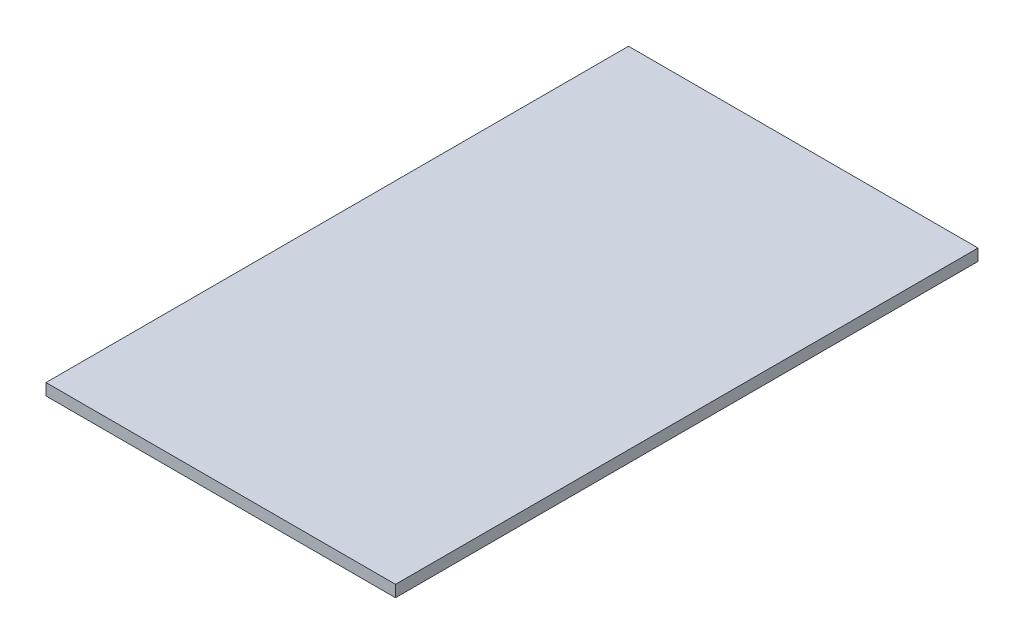
ISO-10303-21;
HEADER;
FILE_DESCRIPTION(('STEP AP214'),'2;1');
FILE_NAME('part.step','',(''),(''),'','','');
FILE_SCHEMA(('AUTOMOTIVE_DESIGN { 1 0 10303 214 1 1 1 1 }'));
ENDSEC;
DATA;
#1=APPLICATION_CONTEXT('core data for automotive mechanical design processes');
#2=APPLICATION_PROTOCOL_DEFINITION('international standard','automotive_design',2000,#1);
#3=PRODUCT_CONTEXT('',#1,'mechanical');
#4=PRODUCT('Part','Part','',(#3));
#5=PRODUCT_RELATED_PRODUCT_CATEGORY('part','',(#4));
#6=PRODUCT_DEFINITION_FORMATION('','',#4);
#7=PRODUCT_DEFINITION_CONTEXT('part definition',#1,'design');
#8=PRODUCT_DEFINITION('design','',#6,#7);
#9=PRODUCT_DEFINITION_SHAPE('','',#8);
#10=(LENGTH_UNIT() NAMED_UNIT(*) SI_UNIT(.MILLI.,.METRE.));
#11=(NAMED_UNIT(*) PLANE_ANGLE_UNIT() SI_UNIT($,.RADIAN.));
#12=(NAMED_UNIT(*) SI_UNIT($,.STERADIAN.) SOLID_ANGLE_UNIT());
#13=UNCERTAINTY_MEASURE_WITH_UNIT(LENGTH_MEASURE(1.E-05),#10,'distance_accuracy_value','');
#14=(GEOMETRIC_REPRESENTATION_CONTEXT(3) GLOBAL_UNCERTAINTY_ASSIGNED_CONTEXT((#13)) GLOBAL_UNIT_ASSIGNED_CONTEXT((#10,
#11,#12)) REPRESENTATION_CONTEXT('',''));
#15=CARTESIAN_POINT('',(0.,0.,0.));
#16=DIRECTION('',(0.,0.,1.));
#17=DIRECTION('',(1.,0.,0.));
#18=AXIS2_PLACEMENT_3D('',#15,#16,#17);
#19=CARTESIAN_POINT('',(30.,2.,-50.));
#20=DIRECTION('',(-1.,0.,0.));
#21=DIRECTION('',(0.,0.,1.));
#22=AXIS2_PLACEMENT_3D('',#19,#20,#21);
#23=PLANE('',#22);
#24=DIRECTION('',(0.,0.,-1.));
#25=VECTOR('',#24,1.);
#26=CARTESIAN_POINT('',(30.,0.,-50.));
#27=LINE('',#26,#25);
#28=CARTESIAN_POINT('',(30.,0.,50.));
#29=VERTEX_POINT('',#28);
#30=CARTESIAN_POINT('',(30.,0.,-50.));
#31=VERTEX_POINT('',#30);
#32=EDGE_CURVE('E96',#29,#31,#27,.T.);
#33=ORIENTED_EDGE('',*,*,#32,.T.);
#34=DIRECTION('',(0.,-1.,0.));
#35=VECTOR('',#34,1.);
#36=CARTESIAN_POINT('',(30.,2.,-50.));
#37=LINE('',#36,#35);
#38=CARTESIAN_POINT('',(30.,2.,-50.));
#39=VERTEX_POINT('',#38);
#40=EDGE_CURVE('E11',#39,#31,#37,.T.);
#41=ORIENTED_EDGE('',*,*,#40,.F.);
#42=DIRECTION('',(0.,0.,-1.));
#43=VECTOR('',#42,1.);
#44=CARTESIAN_POINT('',(30.,2.,-50.));
#45=LINE('',#44,#43);
#46=CARTESIAN_POINT('',(30.,2.,50.));
#47=VERTEX_POINT('',#46);
#48=EDGE_CURVE('E84',#47,#39,#45,.T.);
#49=ORIENTED_EDGE('',*,*,#48,.F.);
#50=DIRECTION('',(0.,-1.,0.));
#51=VECTOR('',#50,1.);
#52=CARTESIAN_POINT('',(30.,2.,50.));
#53=LINE('',#52,#51);
#54=EDGE_CURVE('E92',#47,#29,#53,.T.);
#55=ORIENTED_EDGE('',*,*,#54,.T.);
#56=EDGE_LOOP('',(#33,#41,#49,#55));
#57=FACE_BOUND('',#56,.T.);
#58=ADVANCED_FACE('F33',(#57),#23,.F.);
#59=CARTESIAN_POINT('',(-30.,2.,-50.));
#60=DIRECTION('',(0.,0.,1.));
#61=DIRECTION('',(1.,0.,0.));
#62=AXIS2_PLACEMENT_3D('',#59,#60,#61);
#63=PLANE('',#62);
#64=DIRECTION('',(-1.,0.,0.));
#65=VECTOR('',#64,1.);
#66=CARTESIAN_POINT('',(-30.,0.,-50.));
#67=LINE('',#66,#65);
#68=CARTESIAN_POINT('',(-30.,0.,-50.));
#69=VERTEX_POINT('',#68);
#70=EDGE_CURVE('E88',#31,#69,#67,.T.);
#71=ORIENTED_EDGE('',*,*,#70,.T.);
#72=DIRECTION('',(0.,-1.,0.));
#73=VECTOR('',#72,1.);
#74=CARTESIAN_POINT('',(-30.,2.,-50.));
#75=LINE('',#74,#73);
#76=CARTESIAN_POINT('',(-30.,2.,-50.));
#77=VERTEX_POINT('',#76);
#78=EDGE_CURVE('E41',#77,#69,#75,.T.);
#79=ORIENTED_EDGE('',*,*,#78,.F.);
#80=DIRECTION('',(-1.,0.,0.));
#81=VECTOR('',#80,1.);
#82=CARTESIAN_POINT('',(-30.,2.,-50.));
#83=LINE('',#82,#81);
#84=EDGE_CURVE('E79',#39,#77,#83,.T.);
#85=ORIENTED_EDGE('',*,*,#84,.F.);
#86=ORIENTED_EDGE('',*,*,#40,.T.);
#87=EDGE_LOOP('',(#71,#79,#85,#86));
#88=FACE_BOUND('',#87,.T.);
#89=ADVANCED_FACE('F87',(#88),#63,.F.);
#90=CARTESIAN_POINT('',(-30.,2.,-50.));
#91=DIRECTION('',(1.,0.,0.));
#92=DIRECTION('',(0.,0.,-1.));
#93=AXIS2_PLACEMENT_3D('',#90,#91,#92);
#94=PLANE('',#93);
#95=DIRECTION('',(0.,0.,1.));
#96=VECTOR('',#95,1.);
#97=CARTESIAN_POINT('',(-30.,0.,-50.));
#98=LINE('',#97,#96);
#99=CARTESIAN_POINT('',(-30.,0.,50.));
#100=VERTEX_POINT('',#99);
#101=EDGE_CURVE('E66',#69,#100,#98,.T.);
#102=ORIENTED_EDGE('',*,*,#101,.T.);
#103=DIRECTION('',(0.,-1.,0.));
#104=VECTOR('',#103,1.);
#105=CARTESIAN_POINT('',(-30.,2.,50.));
#106=LINE('',#105,#104);
#107=CARTESIAN_POINT('',(-30.,2.,50.));
#108=VERTEX_POINT('',#107);
#109=EDGE_CURVE('E89',#108,#100,#106,.T.);
#110=ORIENTED_EDGE('',*,*,#109,.F.);
#111=DIRECTION('',(0.,0.,1.));
#112=VECTOR('',#111,1.);
#113=CARTESIAN_POINT('',(-30.,2.,-50.));
#114=LINE('',#113,#112);
#115=EDGE_CURVE('E82',#77,#108,#114,.T.);
#116=ORIENTED_EDGE('',*,*,#115,.F.);
#117=ORIENTED_EDGE('',*,*,#78,.T.);
#118=EDGE_LOOP('',(#102,#110,#116,#117));
#119=FACE_BOUND('',#118,.T.);
#120=ADVANCED_FACE('F90',(#119),#94,.F.);
#121=CARTESIAN_POINT('',(-30.,2.,50.));
#122=DIRECTION('',(0.,0.,-1.));
#123=DIRECTION('',(-1.,0.,0.));
#124=AXIS2_PLACEMENT_3D('',#121,#122,#123);
#125=PLANE('',#124);
#126=DIRECTION('',(1.,0.,0.));
#127=VECTOR('',#126,1.);
#128=CARTESIAN_POINT('',(-30.,0.,50.));
#129=LINE('',#128,#127);
#130=EDGE_CURVE('E72',#100,#29,#129,.T.);
#131=ORIENTED_EDGE('',*,*,#130,.T.);
#132=ORIENTED_EDGE('',*,*,#54,.F.);
#133=DIRECTION('',(1.,0.,0.));
#134=VECTOR('',#133,1.);
#135=CARTESIAN_POINT('',(-30.,2.,50.));
#136=LINE('',#135,#134);
#137=EDGE_CURVE('E49',#108,#47,#136,.T.);
#138=ORIENTED_EDGE('',*,*,#137,.F.);
#139=ORIENTED_EDGE('',*,*,#109,.T.);
#140=EDGE_LOOP('',(#131,#132,#138,#139));
#141=FACE_BOUND('',#140,.T.);
#142=ADVANCED_FACE('F103',(#141),#125,.F.);
#143=CARTESIAN_POINT('',(0.,2.,0.));
#144=DIRECTION('',(0.,1.,0.));
#145=DIRECTION('',(0.,0.,1.));
#146=AXIS2_PLACEMENT_3D('',#143,#144,#145);
#147=PLANE('',#146);
#148=ORIENTED_EDGE('',*,*,#48,.T.);
#149=ORIENTED_EDGE('',*,*,#84,.T.);
#150=ORIENTED_EDGE('',*,*,#115,.T.);
#151=ORIENTED_EDGE('',*,*,#137,.T.);
#152=EDGE_LOOP('',(#148,#149,#150,#151));
#153=FACE_BOUND('',#152,.T.);
#154=ADVANCED_FACE('F80',(#153),#147,.T.);
#155=CARTESIAN_POINT('',(0.,0.,0.));
#156=DIRECTION('',(0.,1.,0.));
#157=DIRECTION('',(0.,0.,1.));
#158=AXIS2_PLACEMENT_3D('',#155,#156,#157);
#159=PLANE('',#158);
#160=ORIENTED_EDGE('',*,*,#32,.F.);
#161=ORIENTED_EDGE('',*,*,#130,.F.);
#162=ORIENTED_EDGE('',*,*,#101,.F.);
#163=ORIENTED_EDGE('',*,*,#70,.F.);
#164=EDGE_LOOP('',(#160,#161,#162,#163));
#165=FACE_BOUND('',#164,.T.);
#166=ADVANCED_FACE('F106',(#165),#159,.F.);
#167=CLOSED_SHELL('',(#58,#89,#120,#142,#154,#166));
#168=MANIFOLD_SOLID_BREP('B2',#167);
#169=ADVANCED_BREP_SHAPE_REPRESENTATION('',(#18,#168),#14);
#170=SHAPE_DEFINITION_REPRESENTATION(#9,#169);
ENDSEC;
END-ISO-10303-21;
